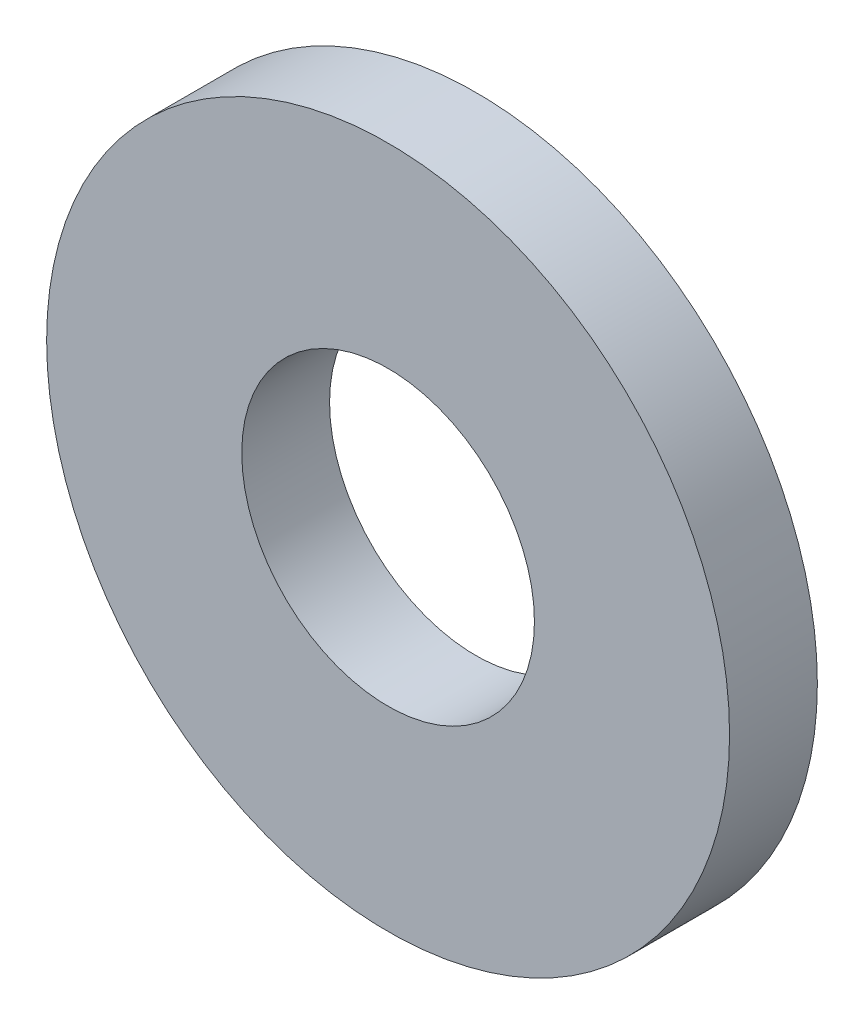
ISO-10303-21;
HEADER;
FILE_DESCRIPTION(('STEP AP214'),'2;1');
FILE_NAME('part.step','',(''),(''),'','','');
FILE_SCHEMA(('AUTOMOTIVE_DESIGN { 1 0 10303 214 1 1 1 1 }'));
ENDSEC;
DATA;
#1=APPLICATION_CONTEXT('core data for automotive mechanical design processes');
#2=APPLICATION_PROTOCOL_DEFINITION('international standard','automotive_design',2000,#1);
#3=PRODUCT_CONTEXT('',#1,'mechanical');
#4=PRODUCT('Part','Part','',(#3));
#5=PRODUCT_RELATED_PRODUCT_CATEGORY('part','',(#4));
#6=PRODUCT_DEFINITION_FORMATION('','',#4);
#7=PRODUCT_DEFINITION_CONTEXT('part definition',#1,'design');
#8=PRODUCT_DEFINITION('design','',#6,#7);
#9=PRODUCT_DEFINITION_SHAPE('','',#8);
#10=(LENGTH_UNIT() NAMED_UNIT(*) SI_UNIT(.MILLI.,.METRE.));
#11=(NAMED_UNIT(*) PLANE_ANGLE_UNIT() SI_UNIT($,.RADIAN.));
#12=(NAMED_UNIT(*) SI_UNIT($,.STERADIAN.) SOLID_ANGLE_UNIT());
#13=UNCERTAINTY_MEASURE_WITH_UNIT(LENGTH_MEASURE(1.E-05),#10,'distance_accuracy_value','');
#14=(GEOMETRIC_REPRESENTATION_CONTEXT(3) GLOBAL_UNCERTAINTY_ASSIGNED_CONTEXT((#13)) GLOBAL_UNIT_ASSIGNED_CONTEXT((#10,
#11,#12)) REPRESENTATION_CONTEXT('',''));
#15=CARTESIAN_POINT('',(0.,0.,0.));
#16=DIRECTION('',(0.,0.,1.));
#17=DIRECTION('',(1.,0.,0.));
#18=AXIS2_PLACEMENT_3D('',#15,#16,#17);
#19=CARTESIAN_POINT('',(0.,0.,0.45));
#20=DIRECTION('',(0.,0.,1.));
#21=DIRECTION('',(1.,0.,0.));
#22=AXIS2_PLACEMENT_3D('',#19,#20,#21);
#23=PLANE('',#22);
#24=CARTESIAN_POINT('',(0.,0.,0.45));
#25=DIRECTION('',(0.,0.,1.));
#26=DIRECTION('',(1.,0.,0.));
#27=AXIS2_PLACEMENT_3D('',#24,#25,#26);
#28=CIRCLE('',#27,3.5);
#29=CARTESIAN_POINT('',(3.5,0.,0.45));
#30=VERTEX_POINT('',#29);
#31=EDGE_CURVE('E10',#30,#30,#28,.T.);
#32=ORIENTED_EDGE('',*,*,#31,.T.);
#33=EDGE_LOOP('',(#32));
#34=FACE_BOUND('',#33,.T.);
#35=CARTESIAN_POINT('',(0.,0.,0.45));
#36=DIRECTION('',(0.,0.,1.));
#37=DIRECTION('',(1.,0.,0.));
#38=AXIS2_PLACEMENT_3D('',#35,#36,#37);
#39=CIRCLE('',#38,1.5);
#40=CARTESIAN_POINT('',(1.5,0.,0.45));
#41=VERTEX_POINT('',#40);
#42=EDGE_CURVE('E42',#41,#41,#39,.T.);
#43=ORIENTED_EDGE('',*,*,#42,.F.);
#44=EDGE_LOOP('',(#43));
#45=FACE_BOUND('',#44,.T.);
#46=ADVANCED_FACE('F31',(#34,#45),#23,.T.);
#47=CARTESIAN_POINT('',(0.,0.,-0.45));
#48=DIRECTION('',(0.,0.,1.));
#49=DIRECTION('',(1.,0.,0.));
#50=AXIS2_PLACEMENT_3D('',#47,#48,#49);
#51=PLANE('',#50);
#52=CARTESIAN_POINT('',(0.,0.,-0.45));
#53=DIRECTION('',(0.,0.,1.));
#54=DIRECTION('',(1.,0.,0.));
#55=AXIS2_PLACEMENT_3D('',#52,#53,#54);
#56=CIRCLE('',#55,3.5);
#57=CARTESIAN_POINT('',(3.5,0.,-0.45));
#58=VERTEX_POINT('',#57);
#59=EDGE_CURVE('E35',#58,#58,#56,.T.);
#60=ORIENTED_EDGE('',*,*,#59,.F.);
#61=EDGE_LOOP('',(#60));
#62=FACE_BOUND('',#61,.T.);
#63=CARTESIAN_POINT('',(0.,0.,-0.45));
#64=DIRECTION('',(0.,0.,1.));
#65=DIRECTION('',(1.,0.,0.));
#66=AXIS2_PLACEMENT_3D('',#63,#64,#65);
#67=CIRCLE('',#66,1.5);
#68=CARTESIAN_POINT('',(1.5,0.,-0.45));
#69=VERTEX_POINT('',#68);
#70=EDGE_CURVE('E44',#69,#69,#67,.T.);
#71=ORIENTED_EDGE('',*,*,#70,.T.);
#72=EDGE_LOOP('',(#71));
#73=FACE_BOUND('',#72,.T.);
#74=ADVANCED_FACE('F54',(#62,#73),#51,.F.);
#75=CARTESIAN_POINT('',(0.,0.,0.45));
#76=DIRECTION('',(0.,0.,-1.));
#77=DIRECTION('',(-1.,0.,0.));
#78=AXIS2_PLACEMENT_3D('',#75,#76,#77);
#79=CYLINDRICAL_SURFACE('',#78,3.5);
#80=ORIENTED_EDGE('',*,*,#31,.F.);
#81=EDGE_LOOP('',(#80));
#82=FACE_BOUND('',#81,.T.);
#83=ORIENTED_EDGE('',*,*,#59,.T.);
#84=EDGE_LOOP('',(#83));
#85=FACE_BOUND('',#84,.T.);
#86=ADVANCED_FACE('F33',(#82,#85),#79,.T.);
#87=CARTESIAN_POINT('',(0.,0.,0.45));
#88=DIRECTION('',(0.,0.,-1.));
#89=DIRECTION('',(-1.,0.,0.));
#90=AXIS2_PLACEMENT_3D('',#87,#88,#89);
#91=CYLINDRICAL_SURFACE('',#90,1.5);
#92=ORIENTED_EDGE('',*,*,#42,.T.);
#93=EDGE_LOOP('',(#92));
#94=FACE_BOUND('',#93,.T.);
#95=ORIENTED_EDGE('',*,*,#70,.F.);
#96=EDGE_LOOP('',(#95));
#97=FACE_BOUND('',#96,.T.);
#98=ADVANCED_FACE('F50',(#94,#97),#91,.F.);
#99=CLOSED_SHELL('',(#46,#74,#86,#98));
#100=MANIFOLD_SOLID_BREP('B2',#99);
#101=ADVANCED_BREP_SHAPE_REPRESENTATION('',(#18,#100),#14);
#102=SHAPE_DEFINITION_REPRESENTATION(#9,#101);
ENDSEC;
END-ISO-10303-21;
